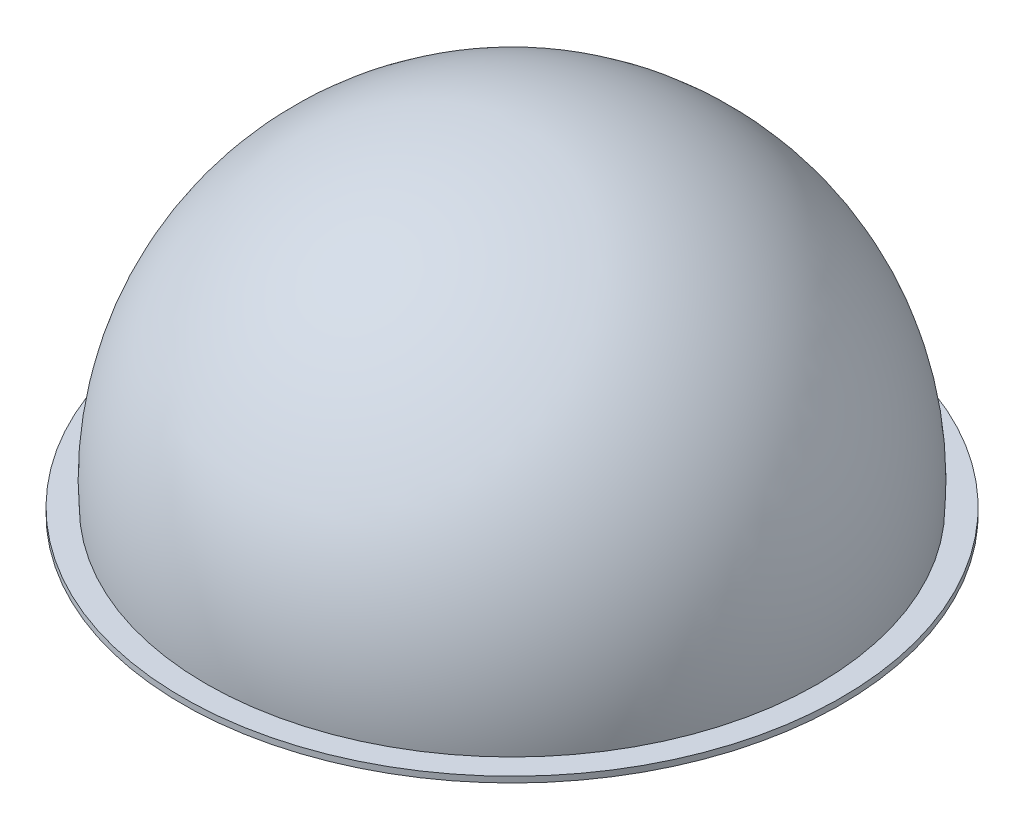
ISO-10303-21;
HEADER;
FILE_DESCRIPTION(('STEP AP214'),'2;1');
FILE_NAME('part.step','',(''),(''),'','','');
FILE_SCHEMA(('AUTOMOTIVE_DESIGN { 1 0 10303 214 1 1 1 1 }'));
ENDSEC;
DATA;
#1=APPLICATION_CONTEXT('core data for automotive mechanical design processes');
#2=APPLICATION_PROTOCOL_DEFINITION('international standard','automotive_design',2000,#1);
#3=PRODUCT_CONTEXT('',#1,'mechanical');
#4=PRODUCT('Part','Part','',(#3));
#5=PRODUCT_RELATED_PRODUCT_CATEGORY('part','',(#4));
#6=PRODUCT_DEFINITION_FORMATION('','',#4);
#7=PRODUCT_DEFINITION_CONTEXT('part definition',#1,'design');
#8=PRODUCT_DEFINITION('design','',#6,#7);
#9=PRODUCT_DEFINITION_SHAPE('','',#8);
#10=(LENGTH_UNIT() NAMED_UNIT(*) SI_UNIT(.MILLI.,.METRE.));
#11=(NAMED_UNIT(*) PLANE_ANGLE_UNIT() SI_UNIT($,.RADIAN.));
#12=(NAMED_UNIT(*) SI_UNIT($,.STERADIAN.) SOLID_ANGLE_UNIT());
#13=UNCERTAINTY_MEASURE_WITH_UNIT(LENGTH_MEASURE(1.E-05),#10,'distance_accuracy_value','');
#14=(GEOMETRIC_REPRESENTATION_CONTEXT(3) GLOBAL_UNCERTAINTY_ASSIGNED_CONTEXT((#13)) GLOBAL_UNIT_ASSIGNED_CONTEXT((#10,
#11,#12)) REPRESENTATION_CONTEXT('',''));
#15=CARTESIAN_POINT('',(0.,0.,0.));
#16=DIRECTION('',(0.,0.,1.));
#17=DIRECTION('',(1.,0.,0.));
#18=AXIS2_PLACEMENT_3D('',#15,#16,#17);
#19=CARTESIAN_POINT('',(0.,0.,0.));
#20=DIRECTION('',(0.,-1.,0.));
#21=DIRECTION('',(0.,0.,-1.));
#22=AXIS2_PLACEMENT_3D('',#19,#20,#21);
#23=PLANE('',#22);
#24=CARTESIAN_POINT('',(0.,0.,0.));
#25=DIRECTION('',(0.,-1.,0.));
#26=DIRECTION('',(0.,0.,-1.));
#27=AXIS2_PLACEMENT_3D('',#24,#25,#26);
#28=CIRCLE('',#27,177.8);
#29=CARTESIAN_POINT('',(0.,0.,-177.8));
#30=VERTEX_POINT('',#29);
#31=EDGE_CURVE('E42',#30,#30,#28,.T.);
#32=ORIENTED_EDGE('',*,*,#31,.F.);
#33=EDGE_LOOP('',(#32));
#34=FACE_BOUND('',#33,.T.);
#35=CARTESIAN_POINT('',(0.,0.,0.));
#36=DIRECTION('',(0.,-1.,0.));
#37=DIRECTION('',(0.,0.,-1.));
#38=AXIS2_PLACEMENT_3D('',#35,#36,#37);
#39=CIRCLE('',#38,165.1);
#40=CARTESIAN_POINT('',(0.,0.,-165.1));
#41=VERTEX_POINT('',#40);
#42=EDGE_CURVE('E10',#41,#41,#39,.T.);
#43=ORIENTED_EDGE('',*,*,#42,.T.);
#44=EDGE_LOOP('',(#43));
#45=FACE_BOUND('',#44,.T.);
#46=ADVANCED_FACE('F31',(#34,#45),#23,.F.);
#47=CARTESIAN_POINT('',(0.,-3.175,0.));
#48=DIRECTION('',(0.,1.,0.));
#49=DIRECTION('',(0.,0.,1.));
#50=AXIS2_PLACEMENT_3D('',#47,#48,#49);
#51=CYLINDRICAL_SURFACE('',#50,177.8);
#52=CARTESIAN_POINT('',(0.,-3.175,0.));
#53=DIRECTION('',(0.,-1.,0.));
#54=DIRECTION('',(0.,0.,-1.));
#55=AXIS2_PLACEMENT_3D('',#52,#53,#54);
#56=CIRCLE('',#55,177.8);
#57=CARTESIAN_POINT('',(0.,-3.175,-177.8));
#58=VERTEX_POINT('',#57);
#59=EDGE_CURVE('E38',#58,#58,#56,.T.);
#60=ORIENTED_EDGE('',*,*,#59,.F.);
#61=EDGE_LOOP('',(#60));
#62=FACE_BOUND('',#61,.T.);
#63=ORIENTED_EDGE('',*,*,#31,.T.);
#64=EDGE_LOOP('',(#63));
#65=FACE_BOUND('',#64,.T.);
#66=ADVANCED_FACE('F56',(#62,#65),#51,.T.);
#67=CARTESIAN_POINT('',(0.,-3.175,0.));
#68=DIRECTION('',(0.,-1.,0.));
#69=DIRECTION('',(0.,0.,-1.));
#70=AXIS2_PLACEMENT_3D('',#67,#68,#69);
#71=PLANE('',#70);
#72=CARTESIAN_POINT('',(0.,-3.175,0.));
#73=DIRECTION('',(0.,-1.,0.));
#74=DIRECTION('',(0.,0.,-1.));
#75=AXIS2_PLACEMENT_3D('',#72,#73,#74);
#76=CIRCLE('',#75,161.644610179245);
#77=CARTESIAN_POINT('',(0.,-3.175,-161.644610179245));
#78=VERTEX_POINT('',#77);
#79=EDGE_CURVE('E47',#78,#78,#76,.T.);
#80=ORIENTED_EDGE('',*,*,#79,.F.);
#81=EDGE_LOOP('',(#80));
#82=FACE_BOUND('',#81,.T.);
#83=ORIENTED_EDGE('',*,*,#59,.T.);
#84=EDGE_LOOP('',(#83));
#85=FACE_BOUND('',#84,.T.);
#86=ADVANCED_FACE('F54',(#82,#85),#71,.T.);
#87=CARTESIAN_POINT('',(0.,12.2464285714285,0.));
#88=DIRECTION('',(0.,1.,0.));
#89=DIRECTION('',(1.,0.,0.));
#90=AXIS2_PLACEMENT_3D('',#87,#88,#89);
#91=SPHERICAL_SURFACE('',#90,165.553571428571);
#92=ORIENTED_EDGE('',*,*,#42,.F.);
#93=EDGE_LOOP('',(#92));
#94=FACE_BOUND('',#93,.T.);
#95=ADVANCED_FACE('F33',(#94),#91,.T.);
#96=CARTESIAN_POINT('',(0.,12.2464285714285,0.));
#97=DIRECTION('',(0.,1.,0.));
#98=DIRECTION('',(1.,0.,0.));
#99=AXIS2_PLACEMENT_3D('',#96,#97,#98);
#100=SPHERICAL_SURFACE('',#99,162.378571428571);
#101=ORIENTED_EDGE('',*,*,#79,.T.);
#102=EDGE_LOOP('',(#101));
#103=FACE_BOUND('',#102,.T.);
#104=ADVANCED_FACE('F52',(#103),#100,.F.);
#105=CLOSED_SHELL('',(#46,#66,#86,#95,#104));
#106=MANIFOLD_SOLID_BREP('B2',#105);
#107=ADVANCED_BREP_SHAPE_REPRESENTATION('',(#18,#106),#14);
#108=SHAPE_DEFINITION_REPRESENTATION(#9,#107);
ENDSEC;
END-ISO-10303-21;
